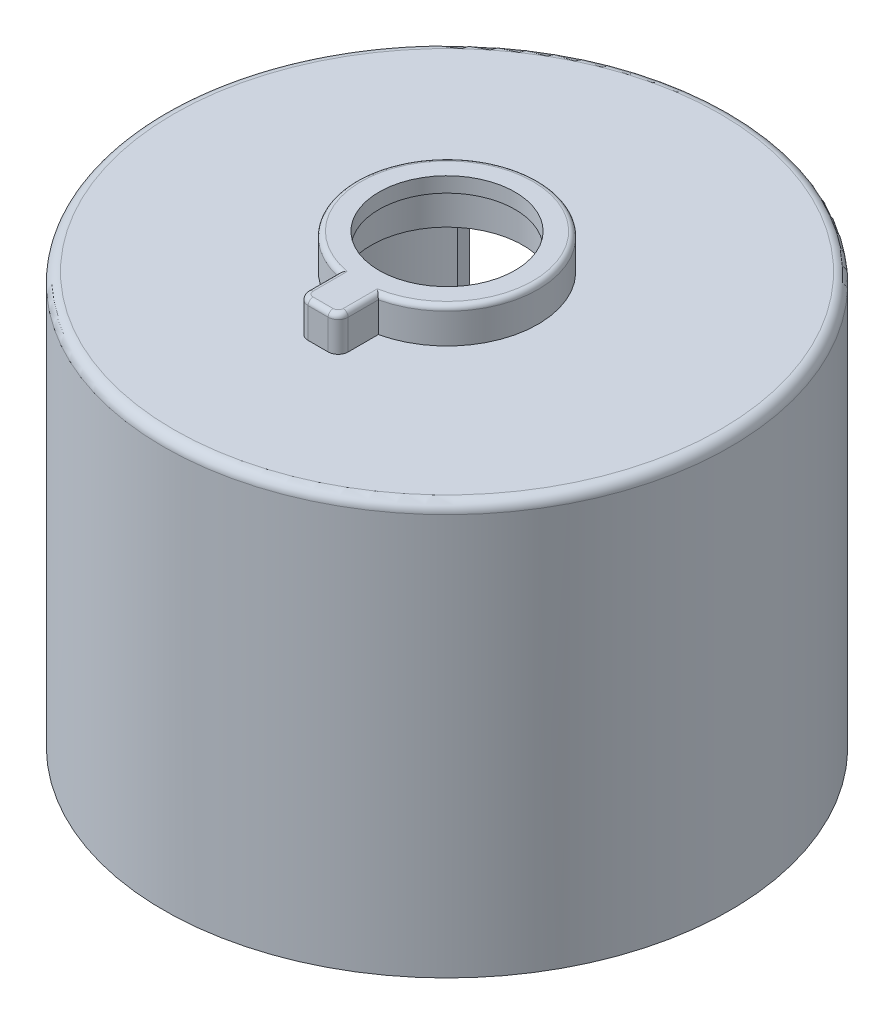
ISO-10303-21;
HEADER;
FILE_DESCRIPTION(('STEP AP214'),'2;1');
FILE_NAME('part.step','',(''),(''),'','','');
FILE_SCHEMA(('AUTOMOTIVE_DESIGN { 1 0 10303 214 1 1 1 1 }'));
ENDSEC;
DATA;
#1=APPLICATION_CONTEXT('core data for automotive mechanical design processes');
#2=APPLICATION_PROTOCOL_DEFINITION('international standard','automotive_design',2000,#1);
#3=PRODUCT_CONTEXT('',#1,'mechanical');
#4=PRODUCT('Part','Part','',(#3));
#5=PRODUCT_RELATED_PRODUCT_CATEGORY('part','',(#4));
#6=PRODUCT_DEFINITION_FORMATION('','',#4);
#7=PRODUCT_DEFINITION_CONTEXT('part definition',#1,'design');
#8=PRODUCT_DEFINITION('design','',#6,#7);
#9=PRODUCT_DEFINITION_SHAPE('','',#8);
#10=(LENGTH_UNIT() NAMED_UNIT(*) SI_UNIT(.MILLI.,.METRE.));
#11=(NAMED_UNIT(*) PLANE_ANGLE_UNIT() SI_UNIT($,.RADIAN.));
#12=(NAMED_UNIT(*) SI_UNIT($,.STERADIAN.) SOLID_ANGLE_UNIT());
#13=UNCERTAINTY_MEASURE_WITH_UNIT(LENGTH_MEASURE(1.E-05),#10,'distance_accuracy_value','');
#14=(GEOMETRIC_REPRESENTATION_CONTEXT(3) GLOBAL_UNCERTAINTY_ASSIGNED_CONTEXT((#13)) GLOBAL_UNIT_ASSIGNED_CONTEXT((#10,
#11,#12)) REPRESENTATION_CONTEXT('',''));
#15=CARTESIAN_POINT('',(0.,0.,0.));
#16=DIRECTION('',(0.,0.,1.));
#17=DIRECTION('',(1.,0.,0.));
#18=AXIS2_PLACEMENT_3D('',#15,#16,#17);
#19=CARTESIAN_POINT('',(0.,41.,0.));
#20=DIRECTION('',(0.,-1.,0.));
#21=DIRECTION('',(0.,0.,-1.));
#22=AXIS2_PLACEMENT_3D('',#19,#20,#21);
#23=CYLINDRICAL_SURFACE('',#22,28.25);
#24=CARTESIAN_POINT('',(0.,40.,0.));
#25=DIRECTION('',(0.,1.,0.));
#26=DIRECTION('',(0.,0.,1.));
#27=AXIS2_PLACEMENT_3D('',#24,#25,#26);
#28=CIRCLE('',#27,28.25);
#29=CARTESIAN_POINT('',(0.,40.,28.25));
#30=VERTEX_POINT('',#29);
#31=EDGE_CURVE('E207',#30,#30,#28,.F.);
#32=ORIENTED_EDGE('',*,*,#31,.T.);
#33=EDGE_LOOP('',(#32));
#34=FACE_BOUND('',#33,.T.);
#35=CARTESIAN_POINT('',(0.,0.,0.));
#36=DIRECTION('',(0.,1.,0.));
#37=DIRECTION('',(0.,0.,1.));
#38=AXIS2_PLACEMENT_3D('',#35,#36,#37);
#39=CIRCLE('',#38,28.25);
#40=CARTESIAN_POINT('',(-18.8271565727493,0.,-21.0618298204401));
#41=VERTEX_POINT('',#40);
#42=CARTESIAN_POINT('',(18.8271565727494,0.,-21.0618298204401));
#43=VERTEX_POINT('',#42);
#44=EDGE_CURVE('E148',#41,#43,#39,.T.);
#45=ORIENTED_EDGE('',*,*,#44,.T.);
#46=DIRECTION('',(0.,-1.,0.));
#47=VECTOR('',#46,1.);
#48=CARTESIAN_POINT('',(18.8271565727494,94.8147587870742,-21.0618298204401));
#49=LINE('',#48,#47);
#50=CARTESIAN_POINT('',(18.8271565727494,37.5,-21.0618298204401));
#51=VERTEX_POINT('',#50);
#52=EDGE_CURVE('E267',#51,#43,#49,.T.);
#53=ORIENTED_EDGE('',*,*,#52,.F.);
#54=CARTESIAN_POINT('',(0.,37.5,0.));
#55=DIRECTION('',(0.,1.,0.));
#56=DIRECTION('',(0.,0.,1.));
#57=AXIS2_PLACEMENT_3D('',#54,#55,#56);
#58=CIRCLE('',#57,28.25);
#59=CARTESIAN_POINT('',(-18.8271565727493,37.5,-21.0618298204401));
#60=VERTEX_POINT('',#59);
#61=EDGE_CURVE('E150',#60,#51,#58,.F.);
#62=ORIENTED_EDGE('',*,*,#61,.F.);
#63=DIRECTION('',(0.,-1.,0.));
#64=VECTOR('',#63,1.);
#65=CARTESIAN_POINT('',(-18.8271565727493,94.8147587870742,-21.0618298204401));
#66=LINE('',#65,#64);
#67=EDGE_CURVE('E134',#60,#41,#66,.T.);
#68=ORIENTED_EDGE('',*,*,#67,.T.);
#69=EDGE_LOOP('',(#45,#53,#62,#68));
#70=FACE_BOUND('',#69,.T.);
#71=ADVANCED_FACE('F36',(#34,#70),#23,.T.);
#72=CARTESIAN_POINT('',(0.,41.,0.));
#73=DIRECTION('',(0.,1.,0.));
#74=DIRECTION('',(0.,0.,1.));
#75=AXIS2_PLACEMENT_3D('',#72,#73,#74);
#76=PLANE('',#75);
#77=CARTESIAN_POINT('',(0.,41.,0.));
#78=DIRECTION('',(0.,1.,0.));
#79=DIRECTION('',(0.,0.,1.));
#80=AXIS2_PLACEMENT_3D('',#77,#78,#79);
#81=CIRCLE('',#80,27.25);
#82=CARTESIAN_POINT('',(0.,41.,27.25));
#83=VERTEX_POINT('',#82);
#84=EDGE_CURVE('E204',#83,#83,#81,.T.);
#85=ORIENTED_EDGE('',*,*,#84,.T.);
#86=EDGE_LOOP('',(#85));
#87=FACE_BOUND('',#86,.T.);
#88=DIRECTION('',(-1.,0.,0.));
#89=VECTOR('',#88,1.);
#90=CARTESIAN_POINT('',(-2.,41.,12.8518712710929));
#91=LINE('',#90,#89);
#92=CARTESIAN_POINT('',(1.,41.,12.8518712710929));
#93=VERTEX_POINT('',#92);
#94=CARTESIAN_POINT('',(-1.,41.,12.8518712710929));
#95=VERTEX_POINT('',#94);
#96=EDGE_CURVE('E277',#93,#95,#91,.T.);
#97=ORIENTED_EDGE('',*,*,#96,.T.);
#98=CARTESIAN_POINT('',(-1.,41.,11.8518712710929));
#99=DIRECTION('',(0.,1.,0.));
#100=DIRECTION('',(0.,0.,1.));
#101=AXIS2_PLACEMENT_3D('',#98,#99,#100);
#102=CIRCLE('',#101,1.);
#103=CARTESIAN_POINT('',(-2.,41.,11.8518712710929));
#104=VERTEX_POINT('',#103);
#105=EDGE_CURVE('E45',#95,#104,#102,.F.);
#106=ORIENTED_EDGE('',*,*,#105,.T.);
#107=DIRECTION('',(0.,0.,-1.));
#108=VECTOR('',#107,1.);
#109=CARTESIAN_POINT('',(-2.,41.,8.85187127109291));
#110=LINE('',#109,#108);
#111=CARTESIAN_POINT('',(-2.,41.,8.85187127109291));
#112=VERTEX_POINT('',#111);
#113=EDGE_CURVE('E274',#104,#112,#110,.T.);
#114=ORIENTED_EDGE('',*,*,#113,.T.);
#115=CARTESIAN_POINT('',(0.,41.,0.));
#116=DIRECTION('',(0.,1.,0.));
#117=DIRECTION('',(0.,0.,1.));
#118=AXIS2_PLACEMENT_3D('',#115,#116,#117);
#119=CIRCLE('',#118,9.075);
#120=CARTESIAN_POINT('',(2.,41.,8.85187127109291));
#121=VERTEX_POINT('',#120);
#122=EDGE_CURVE('E166',#121,#112,#119,.T.);
#123=ORIENTED_EDGE('',*,*,#122,.F.);
#124=DIRECTION('',(0.,0.,1.));
#125=VECTOR('',#124,1.);
#126=CARTESIAN_POINT('',(2.,41.,8.85187127109291));
#127=LINE('',#126,#125);
#128=CARTESIAN_POINT('',(2.,41.,11.8518712710929));
#129=VERTEX_POINT('',#128);
#130=EDGE_CURVE('E271',#121,#129,#127,.T.);
#131=ORIENTED_EDGE('',*,*,#130,.T.);
#132=CARTESIAN_POINT('',(1.,41.,11.8518712710929));
#133=DIRECTION('',(0.,1.,0.));
#134=DIRECTION('',(0.,0.,1.));
#135=AXIS2_PLACEMENT_3D('',#132,#133,#134);
#136=CIRCLE('',#135,1.);
#137=EDGE_CURVE('E13',#129,#93,#136,.F.);
#138=ORIENTED_EDGE('',*,*,#137,.T.);
#139=EDGE_LOOP('',(#97,#106,#114,#123,#131,#138));
#140=FACE_BOUND('',#139,.T.);
#141=ADVANCED_FACE('F312',(#87,#140),#76,.T.);
#142=CARTESIAN_POINT('',(0.,0.,0.));
#143=DIRECTION('',(0.,1.,0.));
#144=DIRECTION('',(0.,0.,1.));
#145=AXIS2_PLACEMENT_3D('',#142,#143,#144);
#146=PLANE('',#145);
#147=CARTESIAN_POINT('',(0.,0.,0.));
#148=DIRECTION('',(0.,-1.,0.));
#149=DIRECTION('',(0.,0.,-1.));
#150=AXIS2_PLACEMENT_3D('',#147,#148,#149);
#151=CIRCLE('',#150,26.75);
#152=CARTESIAN_POINT('',(18.3890776238119,0.,-19.4268969252791));
#153=VERTEX_POINT('',#152);
#154=CARTESIAN_POINT('',(-18.3890776238119,0.,-19.4268969252792));
#155=VERTEX_POINT('',#154);
#156=EDGE_CURVE('E160',#153,#155,#151,.T.);
#157=ORIENTED_EDGE('',*,*,#156,.F.);
#158=DIRECTION('',(-0.258819045102521,0.,0.965925826289068));
#159=VECTOR('',#158,1.);
#160=CARTESIAN_POINT('',(16.65,0.,-12.9365708749069));
#161=LINE('',#160,#159);
#162=EDGE_CURVE('E143',#43,#153,#161,.T.);
#163=ORIENTED_EDGE('',*,*,#162,.F.);
#164=ORIENTED_EDGE('',*,*,#44,.F.);
#165=DIRECTION('',(-0.258819045102514,0.,-0.96592582628907));
#166=VECTOR('',#165,1.);
#167=CARTESIAN_POINT('',(-18.8271565727493,0.,-21.0618298204401));
#168=LINE('',#167,#166);
#169=EDGE_CURVE('E131',#155,#41,#168,.T.);
#170=ORIENTED_EDGE('',*,*,#169,.F.);
#171=EDGE_LOOP('',(#157,#163,#164,#170));
#172=FACE_BOUND('',#171,.T.);
#173=ADVANCED_FACE('F154',(#172),#146,.F.);
#174=CARTESIAN_POINT('',(0.,39.5,0.));
#175=DIRECTION('',(0.,1.,0.));
#176=DIRECTION('',(0.,0.,1.));
#177=AXIS2_PLACEMENT_3D('',#174,#175,#176);
#178=PLANE('',#177);
#179=CARTESIAN_POINT('',(0.,39.5,0.));
#180=DIRECTION('',(0.,1.,0.));
#181=DIRECTION('',(0.,0.,1.));
#182=AXIS2_PLACEMENT_3D('',#179,#180,#181);
#183=CIRCLE('',#182,7.575);
#184=CARTESIAN_POINT('',(0.,39.5,7.575));
#185=VERTEX_POINT('',#184);
#186=EDGE_CURVE('E284',#185,#185,#183,.F.);
#187=ORIENTED_EDGE('',*,*,#186,.F.);
#188=EDGE_LOOP('',(#187));
#189=FACE_BOUND('',#188,.T.);
#190=CARTESIAN_POINT('',(0.,39.5,0.));
#191=DIRECTION('',(0.,1.,0.));
#192=DIRECTION('',(0.,0.,1.));
#193=AXIS2_PLACEMENT_3D('',#190,#191,#192);
#194=CIRCLE('',#193,26.75);
#195=CARTESIAN_POINT('',(0.,39.5,26.75));
#196=VERTEX_POINT('',#195);
#197=EDGE_CURVE('E155',#196,#196,#194,.F.);
#198=ORIENTED_EDGE('',*,*,#197,.T.);
#199=EDGE_LOOP('',(#198));
#200=FACE_BOUND('',#199,.T.);
#201=ADVANCED_FACE('F321',(#189,#200),#178,.F.);
#202=CARTESIAN_POINT('',(0.,116.660425586961,0.));
#203=DIRECTION('',(0.,-1.,0.));
#204=DIRECTION('',(0.,0.,-1.));
#205=AXIS2_PLACEMENT_3D('',#202,#203,#204);
#206=CYLINDRICAL_SURFACE('',#205,26.75);
#207=CARTESIAN_POINT('',(0.,37.5,0.));
#208=DIRECTION('',(0.,1.,0.));
#209=DIRECTION('',(0.,0.,1.));
#210=AXIS2_PLACEMENT_3D('',#207,#208,#209);
#211=CIRCLE('',#210,26.75);
#212=CARTESIAN_POINT('',(-18.3890776238119,37.5,-19.4268969252792));
#213=VERTEX_POINT('',#212);
#214=CARTESIAN_POINT('',(18.3890776238119,37.5,-19.4268969252791));
#215=VERTEX_POINT('',#214);
#216=EDGE_CURVE('E157',#213,#215,#211,.F.);
#217=ORIENTED_EDGE('',*,*,#216,.T.);
#218=DIRECTION('',(0.,-1.,0.));
#219=VECTOR('',#218,1.);
#220=CARTESIAN_POINT('',(18.3890776238119,116.660425586961,-19.4268969252791));
#221=LINE('',#220,#219);
#222=EDGE_CURVE('E171',#215,#153,#221,.T.);
#223=ORIENTED_EDGE('',*,*,#222,.T.);
#224=ORIENTED_EDGE('',*,*,#156,.T.);
#225=DIRECTION('',(0.,-1.,0.));
#226=VECTOR('',#225,1.);
#227=CARTESIAN_POINT('',(-18.3890776238119,116.660425586961,-19.4268969252792));
#228=LINE('',#227,#226);
#229=EDGE_CURVE('E137',#155,#213,#228,.F.);
#230=ORIENTED_EDGE('',*,*,#229,.T.);
#231=EDGE_LOOP('',(#217,#223,#224,#230));
#232=FACE_BOUND('',#231,.T.);
#233=ORIENTED_EDGE('',*,*,#197,.F.);
#234=EDGE_LOOP('',(#233));
#235=FACE_BOUND('',#234,.T.);
#236=ADVANCED_FACE('F294',(#232,#235),#206,.F.);
#237=CARTESIAN_POINT('',(0.,44.5,0.));
#238=DIRECTION('',(0.,1.,0.));
#239=DIRECTION('',(0.,0.,1.));
#240=AXIS2_PLACEMENT_3D('',#237,#238,#239);
#241=PLANE('',#240);
#242=CARTESIAN_POINT('',(1.,44.5,11.8518712710929));
#243=DIRECTION('',(0.,1.,0.));
#244=DIRECTION('',(0.,0.,1.));
#245=AXIS2_PLACEMENT_3D('',#242,#243,#244);
#246=CIRCLE('',#245,0.5);
#247=CARTESIAN_POINT('',(1.5,44.5,11.8518712710929));
#248=VERTEX_POINT('',#247);
#249=CARTESIAN_POINT('',(1.,44.5,12.3518712710929));
#250=VERTEX_POINT('',#249);
#251=EDGE_CURVE('E174',#248,#250,#246,.F.);
#252=ORIENTED_EDGE('',*,*,#251,.F.);
#253=DIRECTION('',(0.,0.,-1.));
#254=VECTOR('',#253,1.);
#255=CARTESIAN_POINT('',(1.5,44.5,0.));
#256=LINE('',#255,#254);
#257=CARTESIAN_POINT('',(1.5,44.5,8.44278538161429));
#258=VERTEX_POINT('',#257);
#259=EDGE_CURVE('E186',#248,#258,#256,.T.);
#260=ORIENTED_EDGE('',*,*,#259,.T.);
#261=CARTESIAN_POINT('',(0.,44.5,0.));
#262=DIRECTION('',(0.,1.,0.));
#263=DIRECTION('',(0.,0.,1.));
#264=AXIS2_PLACEMENT_3D('',#261,#262,#263);
#265=CIRCLE('',#264,8.575);
#266=CARTESIAN_POINT('',(-1.5,44.5,8.44278538161429));
#267=VERTEX_POINT('',#266);
#268=EDGE_CURVE('E184',#258,#267,#265,.T.);
#269=ORIENTED_EDGE('',*,*,#268,.T.);
#270=DIRECTION('',(0.,0.,1.));
#271=VECTOR('',#270,1.);
#272=CARTESIAN_POINT('',(-1.5,44.5,0.));
#273=LINE('',#272,#271);
#274=CARTESIAN_POINT('',(-1.5,44.5,11.8518712710929));
#275=VERTEX_POINT('',#274);
#276=EDGE_CURVE('E182',#267,#275,#273,.T.);
#277=ORIENTED_EDGE('',*,*,#276,.T.);
#278=CARTESIAN_POINT('',(-1.,44.5,11.8518712710929));
#279=DIRECTION('',(0.,1.,0.));
#280=DIRECTION('',(0.,0.,1.));
#281=AXIS2_PLACEMENT_3D('',#278,#279,#280);
#282=CIRCLE('',#281,0.5);
#283=CARTESIAN_POINT('',(-1.,44.5,12.3518712710929));
#284=VERTEX_POINT('',#283);
#285=EDGE_CURVE('E179',#284,#275,#282,.F.);
#286=ORIENTED_EDGE('',*,*,#285,.F.);
#287=DIRECTION('',(1.,0.,0.));
#288=VECTOR('',#287,1.);
#289=CARTESIAN_POINT('',(0.,44.5,12.3518712710929));
#290=LINE('',#289,#288);
#291=EDGE_CURVE('E177',#284,#250,#290,.T.);
#292=ORIENTED_EDGE('',*,*,#291,.T.);
#293=EDGE_LOOP('',(#252,#260,#269,#277,#286,#292));
#294=FACE_BOUND('',#293,.T.);
#295=CARTESIAN_POINT('',(0.,44.5,0.));
#296=DIRECTION('',(0.,1.,0.));
#297=DIRECTION('',(0.,0.,1.));
#298=AXIS2_PLACEMENT_3D('',#295,#296,#297);
#299=CIRCLE('',#298,6.775);
#300=CARTESIAN_POINT('',(0.,44.5,6.775));
#301=VERTEX_POINT('',#300);
#302=EDGE_CURVE('E287',#301,#301,#299,.T.);
#303=ORIENTED_EDGE('',*,*,#302,.F.);
#304=EDGE_LOOP('',(#303));
#305=FACE_BOUND('',#304,.T.);
#306=ADVANCED_FACE('F328',(#294,#305),#241,.T.);
#307=CARTESIAN_POINT('',(0.,44.5,0.));
#308=DIRECTION('',(0.,-1.,0.));
#309=DIRECTION('',(0.,0.,-1.));
#310=AXIS2_PLACEMENT_3D('',#307,#308,#309);
#311=CYLINDRICAL_SURFACE('',#310,9.075);
#312=DIRECTION('',(0.,1.,0.));
#313=VECTOR('',#312,1.);
#314=CARTESIAN_POINT('',(-2.,35.3431457505076,8.85187127109291));
#315=LINE('',#314,#313);
#316=CARTESIAN_POINT('',(-2.,44.,8.85187127109291));
#317=VERTEX_POINT('',#316);
#318=EDGE_CURVE('E275',#112,#317,#315,.T.);
#319=ORIENTED_EDGE('',*,*,#318,.T.);
#320=CARTESIAN_POINT('',(0.,44.,0.));
#321=DIRECTION('',(0.,1.,0.));
#322=DIRECTION('',(0.,0.,1.));
#323=AXIS2_PLACEMENT_3D('',#320,#321,#322);
#324=CIRCLE('',#323,9.075);
#325=CARTESIAN_POINT('',(2.,44.,8.85187127109291));
#326=VERTEX_POINT('',#325);
#327=EDGE_CURVE('E194',#317,#326,#324,.F.);
#328=ORIENTED_EDGE('',*,*,#327,.T.);
#329=DIRECTION('',(0.,1.,0.));
#330=VECTOR('',#329,1.);
#331=CARTESIAN_POINT('',(2.,35.3431457505076,8.85187127109291));
#332=LINE('',#331,#330);
#333=EDGE_CURVE('E270',#121,#326,#332,.T.);
#334=ORIENTED_EDGE('',*,*,#333,.F.);
#335=ORIENTED_EDGE('',*,*,#122,.T.);
#336=EDGE_LOOP('',(#319,#328,#334,#335));
#337=FACE_BOUND('',#336,.T.);
#338=ADVANCED_FACE('F329',(#337),#311,.T.);
#339=CARTESIAN_POINT('',(0.,43.,0.));
#340=DIRECTION('',(0.,1.,0.));
#341=DIRECTION('',(0.,0.,1.));
#342=AXIS2_PLACEMENT_3D('',#339,#340,#341);
#343=PLANE('',#342);
#344=CARTESIAN_POINT('',(0.,43.,0.));
#345=DIRECTION('',(0.,1.,0.));
#346=DIRECTION('',(0.,0.,1.));
#347=AXIS2_PLACEMENT_3D('',#344,#345,#346);
#348=CIRCLE('',#347,6.775);
#349=CARTESIAN_POINT('',(0.,43.,6.775));
#350=VERTEX_POINT('',#349);
#351=EDGE_CURVE('E167',#350,#350,#348,.T.);
#352=ORIENTED_EDGE('',*,*,#351,.T.);
#353=EDGE_LOOP('',(#352));
#354=FACE_BOUND('',#353,.T.);
#355=CARTESIAN_POINT('',(0.,43.,0.));
#356=DIRECTION('',(0.,1.,0.));
#357=DIRECTION('',(0.,0.,1.));
#358=AXIS2_PLACEMENT_3D('',#355,#356,#357);
#359=CIRCLE('',#358,7.575);
#360=CARTESIAN_POINT('',(0.,43.,7.575));
#361=VERTEX_POINT('',#360);
#362=EDGE_CURVE('E164',#361,#361,#359,.T.);
#363=ORIENTED_EDGE('',*,*,#362,.F.);
#364=EDGE_LOOP('',(#363));
#365=FACE_BOUND('',#364,.T.);
#366=ADVANCED_FACE('F332',(#354,#365),#343,.F.);
#367=CARTESIAN_POINT('',(0.,43.,0.));
#368=DIRECTION('',(0.,1.,0.));
#369=DIRECTION('',(0.,0.,1.));
#370=AXIS2_PLACEMENT_3D('',#367,#368,#369);
#371=CYLINDRICAL_SURFACE('',#370,6.775);
#372=ORIENTED_EDGE('',*,*,#351,.F.);
#373=EDGE_LOOP('',(#372));
#374=FACE_BOUND('',#373,.T.);
#375=ORIENTED_EDGE('',*,*,#302,.T.);
#376=EDGE_LOOP('',(#375));
#377=FACE_BOUND('',#376,.T.);
#378=ADVANCED_FACE('F341',(#374,#377),#371,.F.);
#379=CARTESIAN_POINT('',(0.,44.5,0.));
#380=DIRECTION('',(0.,-1.,0.));
#381=DIRECTION('',(0.,0.,-1.));
#382=AXIS2_PLACEMENT_3D('',#379,#380,#381);
#383=CYLINDRICAL_SURFACE('',#382,7.575);
#384=ORIENTED_EDGE('',*,*,#362,.T.);
#385=EDGE_LOOP('',(#384));
#386=FACE_BOUND('',#385,.T.);
#387=ORIENTED_EDGE('',*,*,#186,.T.);
#388=EDGE_LOOP('',(#387));
#389=FACE_BOUND('',#388,.T.);
#390=ADVANCED_FACE('F337',(#386,#389),#383,.F.);
#391=CARTESIAN_POINT('',(-2.,35.3431457505076,8.85187127109291));
#392=DIRECTION('',(-1.,0.,0.));
#393=DIRECTION('',(0.,0.,1.));
#394=AXIS2_PLACEMENT_3D('',#391,#392,#393);
#395=PLANE('',#394);
#396=DIRECTION('',(0.,1.,0.));
#397=VECTOR('',#396,1.);
#398=CARTESIAN_POINT('',(-2.,35.3431457505076,11.8518712710929));
#399=LINE('',#398,#397);
#400=CARTESIAN_POINT('',(-2.,44.,11.8518712710929));
#401=VERTEX_POINT('',#400);
#402=EDGE_CURVE('E196',#104,#401,#399,.T.);
#403=ORIENTED_EDGE('',*,*,#402,.T.);
#404=DIRECTION('',(0.,0.,1.));
#405=VECTOR('',#404,1.);
#406=CARTESIAN_POINT('',(-2.,44.,8.85187127109291));
#407=LINE('',#406,#405);
#408=EDGE_CURVE('E198',#401,#317,#407,.F.);
#409=ORIENTED_EDGE('',*,*,#408,.T.);
#410=ORIENTED_EDGE('',*,*,#318,.F.);
#411=ORIENTED_EDGE('',*,*,#113,.F.);
#412=EDGE_LOOP('',(#403,#409,#410,#411));
#413=FACE_BOUND('',#412,.T.);
#414=ADVANCED_FACE('F340',(#413),#395,.T.);
#415=CARTESIAN_POINT('',(2.,35.3431457505076,8.85187127109291));
#416=DIRECTION('',(1.,0.,0.));
#417=DIRECTION('',(0.,0.,-1.));
#418=AXIS2_PLACEMENT_3D('',#415,#416,#417);
#419=PLANE('',#418);
#420=ORIENTED_EDGE('',*,*,#333,.T.);
#421=DIRECTION('',(0.,0.,-1.));
#422=VECTOR('',#421,1.);
#423=CARTESIAN_POINT('',(2.,44.,8.85187127109291));
#424=LINE('',#423,#422);
#425=CARTESIAN_POINT('',(2.,44.,11.8518712710929));
#426=VERTEX_POINT('',#425);
#427=EDGE_CURVE('E191',#326,#426,#424,.F.);
#428=ORIENTED_EDGE('',*,*,#427,.T.);
#429=DIRECTION('',(0.,1.,0.));
#430=VECTOR('',#429,1.);
#431=CARTESIAN_POINT('',(2.,35.3431457505076,11.8518712710929));
#432=LINE('',#431,#430);
#433=EDGE_CURVE('E189',#426,#129,#432,.F.);
#434=ORIENTED_EDGE('',*,*,#433,.T.);
#435=ORIENTED_EDGE('',*,*,#130,.F.);
#436=EDGE_LOOP('',(#420,#428,#434,#435));
#437=FACE_BOUND('',#436,.T.);
#438=ADVANCED_FACE('F308',(#437),#419,.T.);
#439=CARTESIAN_POINT('',(-2.,35.3431457505076,12.8518712710929));
#440=DIRECTION('',(0.,0.,1.));
#441=DIRECTION('',(1.,0.,0.));
#442=AXIS2_PLACEMENT_3D('',#439,#440,#441);
#443=PLANE('',#442);
#444=DIRECTION('',(1.,0.,0.));
#445=VECTOR('',#444,1.);
#446=CARTESIAN_POINT('',(-2.,44.,12.8518712710929));
#447=LINE('',#446,#445);
#448=CARTESIAN_POINT('',(1.,44.,12.8518712710929));
#449=VERTEX_POINT('',#448);
#450=CARTESIAN_POINT('',(-1.,44.,12.8518712710929));
#451=VERTEX_POINT('',#450);
#452=EDGE_CURVE('E53',#449,#451,#447,.F.);
#453=ORIENTED_EDGE('',*,*,#452,.T.);
#454=DIRECTION('',(0.,1.,0.));
#455=VECTOR('',#454,1.);
#456=CARTESIAN_POINT('',(-1.,35.3431457505076,12.8518712710929));
#457=LINE('',#456,#455);
#458=EDGE_CURVE('E202',#451,#95,#457,.F.);
#459=ORIENTED_EDGE('',*,*,#458,.T.);
#460=ORIENTED_EDGE('',*,*,#96,.F.);
#461=DIRECTION('',(0.,1.,0.));
#462=VECTOR('',#461,1.);
#463=CARTESIAN_POINT('',(1.,35.3431457505076,12.8518712710929));
#464=LINE('',#463,#462);
#465=EDGE_CURVE('E58',#93,#449,#464,.T.);
#466=ORIENTED_EDGE('',*,*,#465,.T.);
#467=EDGE_LOOP('',(#453,#459,#460,#466));
#468=FACE_BOUND('',#467,.T.);
#469=ADVANCED_FACE('F301',(#468),#443,.T.);
#470=CARTESIAN_POINT('',(0.,37.5,0.));
#471=DIRECTION('',(0.,1.,0.));
#472=DIRECTION('',(1.,0.,0.));
#473=AXIS2_PLACEMENT_3D('',#470,#471,#472);
#474=PLANE('',#473);
#475=DIRECTION('',(-0.258819045102514,0.,-0.96592582628907));
#476=VECTOR('',#475,1.);
#477=CARTESIAN_POINT('',(-18.8271565727493,37.5,-21.0618298204401));
#478=LINE('',#477,#476);
#479=EDGE_CURVE('E151',#213,#60,#478,.T.);
#480=ORIENTED_EDGE('',*,*,#479,.T.);
#481=ORIENTED_EDGE('',*,*,#61,.T.);
#482=DIRECTION('',(-0.258819045102522,0.,0.965925826289068));
#483=VECTOR('',#482,1.);
#484=CARTESIAN_POINT('',(16.65,37.5,-12.9365708749069));
#485=LINE('',#484,#483);
#486=EDGE_CURVE('E142',#51,#215,#485,.T.);
#487=ORIENTED_EDGE('',*,*,#486,.T.);
#488=ORIENTED_EDGE('',*,*,#216,.F.);
#489=EDGE_LOOP('',(#480,#481,#487,#488));
#490=FACE_BOUND('',#489,.T.);
#491=ADVANCED_FACE('F299',(#490),#474,.F.);
#492=CARTESIAN_POINT('',(16.65,94.8147587870742,-12.9365708749069));
#493=DIRECTION('',(0.965925826289068,0.,0.258819045102522));
#494=DIRECTION('',(0.258819045102522,0.,-0.965925826289068));
#495=AXIS2_PLACEMENT_3D('',#492,#493,#494);
#496=PLANE('',#495);
#497=ORIENTED_EDGE('',*,*,#486,.F.);
#498=ORIENTED_EDGE('',*,*,#52,.T.);
#499=ORIENTED_EDGE('',*,*,#162,.T.);
#500=ORIENTED_EDGE('',*,*,#222,.F.);
#501=EDGE_LOOP('',(#497,#498,#499,#500));
#502=FACE_BOUND('',#501,.T.);
#503=ADVANCED_FACE('F297',(#502),#496,.F.);
#504=CARTESIAN_POINT('',(-18.8271565727493,94.8147587870742,-21.0618298204401));
#505=DIRECTION('',(-0.96592582628907,0.,0.258819045102514));
#506=DIRECTION('',(0.258819045102514,0.,0.96592582628907));
#507=AXIS2_PLACEMENT_3D('',#504,#505,#506);
#508=PLANE('',#507);
#509=ORIENTED_EDGE('',*,*,#169,.T.);
#510=ORIENTED_EDGE('',*,*,#67,.F.);
#511=ORIENTED_EDGE('',*,*,#479,.F.);
#512=ORIENTED_EDGE('',*,*,#229,.F.);
#513=EDGE_LOOP('',(#509,#510,#511,#512));
#514=FACE_BOUND('',#513,.T.);
#515=ADVANCED_FACE('F133',(#514),#508,.F.);
#516=CARTESIAN_POINT('',(-1.,35.3431457505076,11.8518712710929));
#517=DIRECTION('',(0.,1.,0.));
#518=DIRECTION('',(0.,0.,1.));
#519=AXIS2_PLACEMENT_3D('',#516,#517,#518);
#520=CYLINDRICAL_SURFACE('',#519,1.);
#521=CARTESIAN_POINT('',(-1.,44.,11.8518712710929));
#522=DIRECTION('',(0.,1.,0.));
#523=DIRECTION('',(0.,0.,1.));
#524=AXIS2_PLACEMENT_3D('',#521,#522,#523);
#525=CIRCLE('',#524,1.);
#526=EDGE_CURVE('E40',#401,#451,#525,.T.);
#527=ORIENTED_EDGE('',*,*,#526,.F.);
#528=ORIENTED_EDGE('',*,*,#402,.F.);
#529=ORIENTED_EDGE('',*,*,#105,.F.);
#530=ORIENTED_EDGE('',*,*,#458,.F.);
#531=EDGE_LOOP('',(#527,#528,#529,#530));
#532=FACE_BOUND('',#531,.T.);
#533=ADVANCED_FACE('F386',(#532),#520,.T.);
#534=CARTESIAN_POINT('',(-1.,44.,11.8518712710929));
#535=DIRECTION('',(0.,1.,0.));
#536=DIRECTION('',(0.,0.,1.));
#537=AXIS2_PLACEMENT_3D('',#534,#535,#536);
#538=DEGENERATE_TOROIDAL_SURFACE('',#537,0.5,0.5,.T.);
#539=CARTESIAN_POINT('',(-1.5,44.,11.8518712710929));
#540=DIRECTION('',(0.,0.,1.));
#541=DIRECTION('',(1.,0.,0.));
#542=AXIS2_PLACEMENT_3D('',#539,#540,#541);
#543=CIRCLE('',#542,0.5);
#544=EDGE_CURVE('E250',#401,#275,#543,.F.);
#545=ORIENTED_EDGE('',*,*,#544,.F.);
#546=ORIENTED_EDGE('',*,*,#526,.T.);
#547=CARTESIAN_POINT('',(-1.,44.,12.3518712710929));
#548=DIRECTION('',(-1.,0.,0.));
#549=DIRECTION('',(0.,0.,1.));
#550=AXIS2_PLACEMENT_3D('',#547,#548,#549);
#551=CIRCLE('',#550,0.5);
#552=EDGE_CURVE('E252',#284,#451,#551,.F.);
#553=ORIENTED_EDGE('',*,*,#552,.F.);
#554=ORIENTED_EDGE('',*,*,#285,.T.);
#555=EDGE_LOOP('',(#545,#546,#553,#554));
#556=FACE_BOUND('',#555,.T.);
#557=ADVANCED_FACE('F378',(#556),#538,.T.);
#558=CARTESIAN_POINT('',(1.,35.3431457505076,11.8518712710929));
#559=DIRECTION('',(0.,1.,0.));
#560=DIRECTION('',(0.,0.,1.));
#561=AXIS2_PLACEMENT_3D('',#558,#559,#560);
#562=CYLINDRICAL_SURFACE('',#561,1.);
#563=ORIENTED_EDGE('',*,*,#137,.F.);
#564=ORIENTED_EDGE('',*,*,#433,.F.);
#565=CARTESIAN_POINT('',(1.,44.,11.8518712710929));
#566=DIRECTION('',(0.,1.,0.));
#567=DIRECTION('',(0.,0.,1.));
#568=AXIS2_PLACEMENT_3D('',#565,#566,#567);
#569=CIRCLE('',#568,1.);
#570=EDGE_CURVE('E247',#449,#426,#569,.T.);
#571=ORIENTED_EDGE('',*,*,#570,.F.);
#572=ORIENTED_EDGE('',*,*,#465,.F.);
#573=EDGE_LOOP('',(#563,#564,#571,#572));
#574=FACE_BOUND('',#573,.T.);
#575=ADVANCED_FACE('F373',(#574),#562,.T.);
#576=CARTESIAN_POINT('',(0.,44.,12.3518712710929));
#577=DIRECTION('',(1.,0.,0.));
#578=DIRECTION('',(0.,0.,-1.));
#579=AXIS2_PLACEMENT_3D('',#576,#577,#578);
#580=CYLINDRICAL_SURFACE('',#579,0.5);
#581=ORIENTED_EDGE('',*,*,#552,.T.);
#582=ORIENTED_EDGE('',*,*,#452,.F.);
#583=CARTESIAN_POINT('',(1.,44.,12.3518712710929));
#584=DIRECTION('',(1.,0.,0.));
#585=DIRECTION('',(0.,0.,-1.));
#586=AXIS2_PLACEMENT_3D('',#583,#584,#585);
#587=CIRCLE('',#586,0.5);
#588=EDGE_CURVE('E244',#250,#449,#587,.T.);
#589=ORIENTED_EDGE('',*,*,#588,.F.);
#590=ORIENTED_EDGE('',*,*,#291,.F.);
#591=EDGE_LOOP('',(#581,#582,#589,#590));
#592=FACE_BOUND('',#591,.T.);
#593=ADVANCED_FACE('F234',(#592),#580,.T.);
#594=CARTESIAN_POINT('',(-1.5,44.,0.));
#595=DIRECTION('',(0.,0.,1.));
#596=DIRECTION('',(1.,0.,0.));
#597=AXIS2_PLACEMENT_3D('',#594,#595,#596);
#598=CYLINDRICAL_SURFACE('',#597,0.5);
#599=ORIENTED_EDGE('',*,*,#544,.T.);
#600=ORIENTED_EDGE('',*,*,#276,.F.);
#601=CARTESIAN_POINT('',(-2.,44.,8.85187127109291));
#602=CARTESIAN_POINT('',(-2.00003634934727,44.0237716174083,8.85189921229445));
#603=CARTESIAN_POINT('',(-1.99830734160786,44.0475014972013,8.85051840401771));
#604=CARTESIAN_POINT('',(-1.99162276456721,44.0940560344454,8.84517378361253));
#605=CARTESIAN_POINT('',(-1.98668757489757,44.1168854499101,8.84122628613951));
#606=CARTESIAN_POINT('',(-1.97389898649982,44.1610955708153,8.83098635670143));
#607=CARTESIAN_POINT('',(-1.96605060189598,44.1824786912564,8.82469795379558));
#608=CARTESIAN_POINT('',(-1.94786113609998,44.223434275238,8.81010292960344));
#609=CARTESIAN_POINT('',(-1.9375167370396,44.2430042803393,8.80179362187832));
#610=CARTESIAN_POINT('',(-1.91394881844345,44.2814087226815,8.78282964962604));
#611=CARTESIAN_POINT('',(-1.90056973823291,44.3000838293083,8.77204763233478));
#612=CARTESIAN_POINT('',(-1.87196875961407,44.3348840991442,8.74894947086836));
#613=CARTESIAN_POINT('',(-1.85674598878506,44.3510080467752,8.73663260033176));
#614=CARTESIAN_POINT('',(-1.81705277599301,44.3879841481518,8.70444087261297));
#615=CARTESIAN_POINT('',(-1.79171348782096,44.4072670918027,8.68382587143314));
#616=CARTESIAN_POINT('',(-1.73900817451806,44.4402790889695,8.6407786854601));
#617=CARTESIAN_POINT('',(-1.71163784147675,44.4539959138041,8.61834262812157));
#618=CARTESIAN_POINT('',(-1.65440035376249,44.4766050368887,8.57122927305322));
#619=CARTESIAN_POINT('',(-1.62447642334741,44.4852336713058,8.54649608172866));
#620=CARTESIAN_POINT('',(-1.56415683678073,44.4968139353883,8.49641509179943));
#621=CARTESIAN_POINT('',(-1.53376243689258,44.4997786966212,8.47106885315987));
#622=CARTESIAN_POINT('',(-1.50230300176726,44.4999960209321,8.44471511823415));
#623=CARTESIAN_POINT('',(-1.50115142853639,44.4999999981396,8.44375027274794));
#624=CARTESIAN_POINT('',(-1.5,44.5,8.44278538161429));
#625=B_SPLINE_CURVE_WITH_KNOTS('',3,(#601,#602,#603,#604,#605,#606,#607,#608,#609,#610,#611,
#612,#613,#614,#615,#616,#617,#618,#619,#620,#621,#622,#623,#624),.UNSPECIFIED.,.F.,.F.,(4,2,2,
2,2,2,2,2,2,2,2,4),(0.,0.0711461183365781,0.141844373805034,0.212421505085395,0.28309297407429,
0.358949875027217,0.434842812183006,0.548023647902283,0.661451811256315,0.780333445563893,
0.898939119272165,0.903446152001235),.UNSPECIFIED.);
#626=EDGE_CURVE('E237',#317,#267,#625,.T.);
#627=ORIENTED_EDGE('',*,*,#626,.F.);
#628=ORIENTED_EDGE('',*,*,#408,.F.);
#629=EDGE_LOOP('',(#599,#600,#627,#628));
#630=FACE_BOUND('',#629,.T.);
#631=ADVANCED_FACE('F229',(#630),#598,.T.);
#632=CARTESIAN_POINT('',(1.,44.,11.8518712710929));
#633=DIRECTION('',(0.,1.,0.));
#634=DIRECTION('',(0.,0.,1.));
#635=AXIS2_PLACEMENT_3D('',#632,#633,#634);
#636=DEGENERATE_TOROIDAL_SURFACE('',#635,0.5,0.5,.T.);
#637=ORIENTED_EDGE('',*,*,#588,.T.);
#638=ORIENTED_EDGE('',*,*,#570,.T.);
#639=CARTESIAN_POINT('',(1.5,44.,11.8518712710929));
#640=DIRECTION('',(0.,0.,1.));
#641=DIRECTION('',(1.,0.,0.));
#642=AXIS2_PLACEMENT_3D('',#639,#640,#641);
#643=CIRCLE('',#642,0.5);
#644=EDGE_CURVE('E219',#248,#426,#643,.F.);
#645=ORIENTED_EDGE('',*,*,#644,.F.);
#646=ORIENTED_EDGE('',*,*,#251,.T.);
#647=EDGE_LOOP('',(#637,#638,#645,#646));
#648=FACE_BOUND('',#647,.T.);
#649=ADVANCED_FACE('F233',(#648),#636,.T.);
#650=CARTESIAN_POINT('',(0.,44.,0.));
#651=DIRECTION('',(0.,1.,0.));
#652=DIRECTION('',(0.,0.,1.));
#653=AXIS2_PLACEMENT_3D('',#650,#651,#652);
#654=TOROIDAL_SURFACE('',#653,8.575,0.5);
#655=ORIENTED_EDGE('',*,*,#626,.T.);
#656=ORIENTED_EDGE('',*,*,#268,.F.);
#657=CARTESIAN_POINT('',(2.,44.,8.85187127109291));
#658=CARTESIAN_POINT('',(2.00003634934727,44.0237716174083,8.85189921229445));
#659=CARTESIAN_POINT('',(1.99830734160786,44.0475014972013,8.85051840401771));
#660=CARTESIAN_POINT('',(1.99162276456721,44.0940560344454,8.84517378361253));
#661=CARTESIAN_POINT('',(1.98668757489757,44.1168854499101,8.84122628613951));
#662=CARTESIAN_POINT('',(1.97389898649982,44.1610955708153,8.83098635670143));
#663=CARTESIAN_POINT('',(1.96605060189598,44.1824786912564,8.82469795379558));
#664=CARTESIAN_POINT('',(1.94786113609998,44.223434275238,8.81010292960344));
#665=CARTESIAN_POINT('',(1.9375167370396,44.2430042803393,8.80179362187832));
#666=CARTESIAN_POINT('',(1.91394881844345,44.2814087226815,8.78282964962604));
#667=CARTESIAN_POINT('',(1.90056973823291,44.3000838293083,8.77204763233478));
#668=CARTESIAN_POINT('',(1.87196875961407,44.3348840991442,8.74894947086836));
#669=CARTESIAN_POINT('',(1.85674598878506,44.3510080467752,8.73663260033176));
#670=CARTESIAN_POINT('',(1.81705277599301,44.3879841481518,8.70444087261297));
#671=CARTESIAN_POINT('',(1.79171348782096,44.4072670918027,8.68382587143314));
#672=CARTESIAN_POINT('',(1.73900817451806,44.4402790889695,8.6407786854601));
#673=CARTESIAN_POINT('',(1.71163784147675,44.4539959138041,8.61834262812157));
#674=CARTESIAN_POINT('',(1.65440035376249,44.4766050368887,8.57122927305322));
#675=CARTESIAN_POINT('',(1.62447642334741,44.4852336713058,8.54649608172866));
#676=CARTESIAN_POINT('',(1.56415683678073,44.4968139353883,8.49641509179943));
#677=CARTESIAN_POINT('',(1.53376243689258,44.4997786966212,8.47106885315987));
#678=CARTESIAN_POINT('',(1.50230300176726,44.4999960209321,8.44471511823415));
#679=CARTESIAN_POINT('',(1.50115142853639,44.4999999981396,8.44375027274794));
#680=CARTESIAN_POINT('',(1.5,44.5,8.44278538161429));
#681=B_SPLINE_CURVE_WITH_KNOTS('',3,(#657,#658,#659,#660,#661,#662,#663,#664,#665,#666,#667,
#668,#669,#670,#671,#672,#673,#674,#675,#676,#677,#678,#679,#680),.UNSPECIFIED.,.F.,.F.,(4,2,2,
2,2,2,2,2,2,2,2,4),(0.,0.0711461183365781,0.141844373805034,0.212421505085395,0.28309297407429,
0.358949875027217,0.434842812183006,0.548023647902283,0.661451811256315,0.780333445563893,
0.898939119272165,0.903446152001235),.UNSPECIFIED.);
#682=EDGE_CURVE('E211',#326,#258,#681,.T.);
#683=ORIENTED_EDGE('',*,*,#682,.F.);
#684=ORIENTED_EDGE('',*,*,#327,.F.);
#685=EDGE_LOOP('',(#655,#656,#683,#684));
#686=FACE_BOUND('',#685,.T.);
#687=ADVANCED_FACE('F221',(#686),#654,.T.);
#688=CARTESIAN_POINT('',(1.5,44.,0.));
#689=DIRECTION('',(0.,0.,-1.));
#690=DIRECTION('',(-1.,0.,0.));
#691=AXIS2_PLACEMENT_3D('',#688,#689,#690);
#692=CYLINDRICAL_SURFACE('',#691,0.5);
#693=ORIENTED_EDGE('',*,*,#644,.T.);
#694=ORIENTED_EDGE('',*,*,#427,.F.);
#695=ORIENTED_EDGE('',*,*,#682,.T.);
#696=ORIENTED_EDGE('',*,*,#259,.F.);
#697=EDGE_LOOP('',(#693,#694,#695,#696));
#698=FACE_BOUND('',#697,.T.);
#699=ADVANCED_FACE('F224',(#698),#692,.T.);
#700=CARTESIAN_POINT('',(0.,40.,0.));
#701=DIRECTION('',(0.,1.,0.));
#702=DIRECTION('',(0.,0.,1.));
#703=AXIS2_PLACEMENT_3D('',#700,#701,#702);
#704=TOROIDAL_SURFACE('',#703,27.25,1.);
#705=ORIENTED_EDGE('',*,*,#31,.F.);
#706=EDGE_LOOP('',(#705));
#707=FACE_BOUND('',#706,.T.);
#708=ORIENTED_EDGE('',*,*,#84,.F.);
#709=EDGE_LOOP('',(#708));
#710=FACE_BOUND('',#709,.T.);
#711=ADVANCED_FACE('F38',(#707,#710),#704,.T.);
#712=CLOSED_SHELL('',(#71,#141,#173,#201,#236,#306,#338,#366,#378,#390,#414,#438,#469,#491,#503,
#515,#533,#557,#575,#593,#631,#649,#687,#699,#711));
#713=MANIFOLD_SOLID_BREP('B2',#712);
#714=ADVANCED_BREP_SHAPE_REPRESENTATION('',(#18,#713),#14);
#715=SHAPE_DEFINITION_REPRESENTATION(#9,#714);
ENDSEC;
END-ISO-10303-21;
